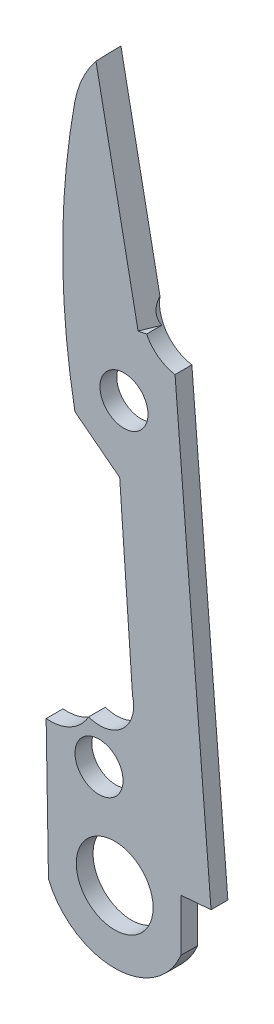
ISO-10303-21;
HEADER;
FILE_DESCRIPTION(('STEP AP214'),'2;1');
FILE_NAME('part.step','',(''),(''),'','','');
FILE_SCHEMA(('AUTOMOTIVE_DESIGN { 1 0 10303 214 1 1 1 1 }'));
ENDSEC;
DATA;
#1=APPLICATION_CONTEXT('core data for automotive mechanical design processes');
#2=APPLICATION_PROTOCOL_DEFINITION('international standard','automotive_design',2000,#1);
#3=PRODUCT_CONTEXT('',#1,'mechanical');
#4=PRODUCT('Part','Part','',(#3));
#5=PRODUCT_RELATED_PRODUCT_CATEGORY('part','',(#4));
#6=PRODUCT_DEFINITION_FORMATION('','',#4);
#7=PRODUCT_DEFINITION_CONTEXT('part definition',#1,'design');
#8=PRODUCT_DEFINITION('design','',#6,#7);
#9=PRODUCT_DEFINITION_SHAPE('','',#8);
#10=(LENGTH_UNIT() NAMED_UNIT(*) SI_UNIT(.MILLI.,.METRE.));
#11=(NAMED_UNIT(*) PLANE_ANGLE_UNIT() SI_UNIT($,.RADIAN.));
#12=(NAMED_UNIT(*) SI_UNIT($,.STERADIAN.) SOLID_ANGLE_UNIT());
#13=UNCERTAINTY_MEASURE_WITH_UNIT(LENGTH_MEASURE(1.E-05),#10,'distance_accuracy_value','');
#14=(GEOMETRIC_REPRESENTATION_CONTEXT(3) GLOBAL_UNCERTAINTY_ASSIGNED_CONTEXT((#13)) GLOBAL_UNIT_ASSIGNED_CONTEXT((#10,
#11,#12)) REPRESENTATION_CONTEXT('',''));
#15=CARTESIAN_POINT('',(0.,0.,0.));
#16=DIRECTION('',(0.,0.,1.));
#17=DIRECTION('',(1.,0.,0.));
#18=AXIS2_PLACEMENT_3D('',#15,#16,#17);
#19=CARTESIAN_POINT('',(58.298969551053,52.7412036113282,0.889000000000001));
#20=DIRECTION('',(0.,0.,-1.));
#21=DIRECTION('',(-1.,0.,0.));
#22=AXIS2_PLACEMENT_3D('',#19,#20,#21);
#23=PLANE('',#22);
#24=CARTESIAN_POINT('',(55.1062842474313,18.8908068192465,0.889000000000001));
#25=DIRECTION('',(0.,0.,1.));
#26=DIRECTION('',(1.,0.,0.));
#27=AXIS2_PLACEMENT_3D('',#24,#25,#26);
#28=CIRCLE('',#27,2.032);
#29=CARTESIAN_POINT('',(57.1382842474313,18.8908068192465,0.889000000000001));
#30=VERTEX_POINT('',#29);
#31=EDGE_CURVE('E310',#30,#30,#28,.T.);
#32=ORIENTED_EDGE('',*,*,#31,.F.);
#33=EDGE_LOOP('',(#32));
#34=FACE_BOUND('',#33,.T.);
#35=DIRECTION('',(0.980952450730075,0.19424801004556,0.));
#36=VECTOR('',#35,1.);
#37=CARTESIAN_POINT('',(56.343765892356,44.9053107233274,0.889000000000001));
#38=LINE('',#37,#36);
#39=CARTESIAN_POINT('',(56.343765892356,44.9053107233274,0.889000000000001));
#40=VERTEX_POINT('',#39);
#41=CARTESIAN_POINT('',(56.795451542172,44.9947534262612,0.889000000000001));
#42=VERTEX_POINT('',#41);
#43=EDGE_CURVE('E295',#40,#42,#38,.T.);
#44=ORIENTED_EDGE('',*,*,#43,.F.);
#45=DIRECTION('',(-0.194248010045559,0.980952450730075,0.));
#46=VECTOR('',#45,1.);
#47=CARTESIAN_POINT('',(56.343765892356,44.9053107233274,0.889000000000001));
#48=LINE('',#47,#46);
#49=CARTESIAN_POINT('',(54.1176052106896,56.1474221657424,0.889000000000001));
#50=VERTEX_POINT('',#49);
#51=EDGE_CURVE('E304',#40,#50,#48,.T.);
#52=ORIENTED_EDGE('',*,*,#51,.T.);
#53=CARTESIAN_POINT('',(58.298969551053,52.7412036113282,0.889000000000001));
#54=DIRECTION('',(0.,0.,1.));
#55=DIRECTION('',(-1.,0.,0.));
#56=AXIS2_PLACEMENT_3D('',#53,#54,#55);
#57=CIRCLE('',#56,5.39315608779291);
#58=CARTESIAN_POINT('',(52.9934122039925,53.7092913265433,0.889000000000001));
#59=VERTEX_POINT('',#58);
#60=EDGE_CURVE('E132',#50,#59,#57,.T.);
#61=ORIENTED_EDGE('',*,*,#60,.T.);
#62=CARTESIAN_POINT('',(91.6745057375456,46.6512785653269,0.889000000000001));
#63=DIRECTION('',(0.,0.,1.));
#64=DIRECTION('',(1.,0.,0.));
#65=AXIS2_PLACEMENT_3D('',#62,#63,#64);
#66=CIRCLE('',#65,39.3197474698017);
#67=CARTESIAN_POINT('',(53.003003996925,39.540899235491,0.889000000000001));
#68=VERTEX_POINT('',#67);
#69=EDGE_CURVE('E271',#59,#68,#66,.T.);
#70=ORIENTED_EDGE('',*,*,#69,.T.);
#71=DIRECTION('',(0.791232931065585,-0.611514880274686,0.));
#72=VECTOR('',#71,1.);
#73=CARTESIAN_POINT('',(53.003003996925,39.540899235491,0.889000000000001));
#74=LINE('',#73,#72);
#75=CARTESIAN_POINT('',(55.3713844992906,37.7104649063757,0.889000000000001));
#76=VERTEX_POINT('',#75);
#77=EDGE_CURVE('E341',#68,#76,#74,.T.);
#78=ORIENTED_EDGE('',*,*,#77,.T.);
#79=DIRECTION('',(0.0703645759459659,-0.997521341351625,0.));
#80=VECTOR('',#79,1.);
#81=CARTESIAN_POINT('',(55.3713844992906,37.7104649063757,0.889000000000001));
#82=LINE('',#81,#80);
#83=CARTESIAN_POINT('',(56.0523119481275,28.0573169552183,0.889000000000001));
#84=VERTEX_POINT('',#83);
#85=EDGE_CURVE('E344',#76,#84,#82,.T.);
#86=ORIENTED_EDGE('',*,*,#85,.T.);
#87=CARTESIAN_POINT('',(54.3184141104705,27.6130962247955,0.889000000000001));
#88=DIRECTION('',(0.,0.,-1.));
#89=DIRECTION('',(-1.,0.,0.));
#90=AXIS2_PLACEMENT_3D('',#87,#88,#89);
#91=CIRCLE('',#90,1.78989769784999);
#92=CARTESIAN_POINT('',(53.7244696692905,25.9246165034011,0.889000000000001));
#93=VERTEX_POINT('',#92);
#94=EDGE_CURVE('E347',#84,#93,#91,.T.);
#95=ORIENTED_EDGE('',*,*,#94,.T.);
#96=CARTESIAN_POINT('',(51.6858105737163,27.0435972886485,0.889000000000001));
#97=DIRECTION('',(0.,0.,-1.));
#98=DIRECTION('',(-1.,0.,0.));
#99=AXIS2_PLACEMENT_3D('',#96,#97,#98);
#100=CIRCLE('',#99,2.32556421234084);
#101=CARTESIAN_POINT('',(51.4813817478412,24.7270356639832,0.889000000000001));
#102=VERTEX_POINT('',#101);
#103=EDGE_CURVE('E350',#93,#102,#100,.T.);
#104=ORIENTED_EDGE('',*,*,#103,.T.);
#105=DIRECTION('',(0.0169800187734466,-0.999855829088601,0.));
#106=VECTOR('',#105,1.);
#107=CARTESIAN_POINT('',(51.4813817478412,24.7270356639832,0.889000000000001));
#108=LINE('',#107,#106);
#109=CARTESIAN_POINT('',(51.6050919668254,17.4424510460544,0.889000000000001));
#110=VERTEX_POINT('',#109);
#111=EDGE_CURVE('E353',#102,#110,#108,.T.);
#112=ORIENTED_EDGE('',*,*,#111,.T.);
#113=CARTESIAN_POINT('',(55.1062842474313,18.8908068192465,0.889000000000001));
#114=DIRECTION('',(0.,0.,1.));
#115=DIRECTION('',(1.,0.,0.));
#116=AXIS2_PLACEMENT_3D('',#113,#114,#115);
#117=CIRCLE('',#116,3.78894204647071);
#118=CARTESIAN_POINT('',(58.6074765280373,17.4424510460544,0.889000000000001));
#119=VERTEX_POINT('',#118);
#120=EDGE_CURVE('E165',#110,#119,#117,.T.);
#121=ORIENTED_EDGE('',*,*,#120,.T.);
#122=DIRECTION('',(0.,1.,0.));
#123=VECTOR('',#122,1.);
#124=CARTESIAN_POINT('',(58.6074765280373,20.1999738695472,0.889000000000001));
#125=LINE('',#124,#123);
#126=CARTESIAN_POINT('',(58.6074765280373,20.1999738695472,0.889000000000001));
#127=VERTEX_POINT('',#126);
#128=EDGE_CURVE('E157',#119,#127,#125,.T.);
#129=ORIENTED_EDGE('',*,*,#128,.T.);
#130=DIRECTION('',(0.996750440683807,0.080551592142162,0.));
#131=VECTOR('',#130,1.);
#132=CARTESIAN_POINT('',(60.2030911210144,20.328922190675,0.889000000000001));
#133=LINE('',#132,#131);
#134=CARTESIAN_POINT('',(60.2030911210144,20.328922190675,0.889000000000001));
#135=VERTEX_POINT('',#134);
#136=EDGE_CURVE('E162',#127,#135,#133,.T.);
#137=ORIENTED_EDGE('',*,*,#136,.T.);
#138=DIRECTION('',(-0.0805515921421626,0.996750440683807,0.));
#139=VECTOR('',#138,1.);
#140=CARTESIAN_POINT('',(58.298969551053,43.8906416241651,0.889000000000001));
#141=LINE('',#140,#139);
#142=CARTESIAN_POINT('',(58.298969551053,43.8906416241651,0.889000000000001));
#143=VERTEX_POINT('',#142);
#144=EDGE_CURVE('E75',#135,#143,#141,.T.);
#145=ORIENTED_EDGE('',*,*,#144,.T.);
#146=CARTESIAN_POINT('',(58.6074765280373,45.8865087354998,0.889000000000001));
#147=DIRECTION('',(0.,0.,-1.));
#148=DIRECTION('',(1.,0.,0.));
#149=AXIS2_PLACEMENT_3D('',#146,#147,#148);
#150=CIRCLE('',#149,2.01956977620369);
#151=EDGE_CURVE('E188',#143,#42,#150,.T.);
#152=ORIENTED_EDGE('',*,*,#151,.T.);
#153=EDGE_LOOP('',(#44,#52,#61,#70,#78,#86,#95,#104,#112,#121,#129,#137,#145,#152));
#154=FACE_BOUND('',#153,.T.);
#155=CARTESIAN_POINT('',(54.2776006803347,23.9125007125022,0.889000000000001));
#156=DIRECTION('',(0.,0.,1.));
#157=DIRECTION('',(1.,0.,0.));
#158=AXIS2_PLACEMENT_3D('',#155,#156,#157);
#159=CIRCLE('',#158,1.27);
#160=CARTESIAN_POINT('',(55.5476006803347,23.9125007125022,0.889000000000001));
#161=VERTEX_POINT('',#160);
#162=EDGE_CURVE('E200',#161,#161,#159,.T.);
#163=ORIENTED_EDGE('',*,*,#162,.F.);
#164=EDGE_LOOP('',(#163));
#165=FACE_BOUND('',#164,.T.);
#166=CARTESIAN_POINT('',(55.596905373983,41.3468012643006,0.889000000000001));
#167=DIRECTION('',(0.,0.,1.));
#168=DIRECTION('',(1.,0.,0.));
#169=AXIS2_PLACEMENT_3D('',#166,#167,#168);
#170=CIRCLE('',#169,1.27);
#171=CARTESIAN_POINT('',(56.866905373983,41.3468012643006,0.889000000000001));
#172=VERTEX_POINT('',#171);
#173=EDGE_CURVE('E323',#172,#172,#170,.T.);
#174=ORIENTED_EDGE('',*,*,#173,.F.);
#175=EDGE_LOOP('',(#174));
#176=FACE_BOUND('',#175,.T.);
#177=ADVANCED_FACE('F57',(#34,#154,#165,#176),#23,.F.);
#178=CARTESIAN_POINT('',(58.298969551053,52.7412036113282,0.));
#179=DIRECTION('',(0.,0.,-1.));
#180=DIRECTION('',(-1.,0.,0.));
#181=AXIS2_PLACEMENT_3D('',#178,#179,#180);
#182=PLANE('',#181);
#183=CARTESIAN_POINT('',(55.1062842474313,18.8908068192465,0.));
#184=DIRECTION('',(0.,0.,1.));
#185=DIRECTION('',(1.,0.,0.));
#186=AXIS2_PLACEMENT_3D('',#183,#184,#185);
#187=CIRCLE('',#186,2.032);
#188=CARTESIAN_POINT('',(57.1382842474313,18.8908068192465,0.));
#189=VERTEX_POINT('',#188);
#190=EDGE_CURVE('E315',#189,#189,#187,.T.);
#191=ORIENTED_EDGE('',*,*,#190,.T.);
#192=EDGE_LOOP('',(#191));
#193=FACE_BOUND('',#192,.T.);
#194=CARTESIAN_POINT('',(54.2776006803347,23.9125007125022,0.));
#195=DIRECTION('',(0.,0.,1.));
#196=DIRECTION('',(1.,0.,0.));
#197=AXIS2_PLACEMENT_3D('',#194,#195,#196);
#198=CIRCLE('',#197,1.27);
#199=CARTESIAN_POINT('',(55.5476006803347,23.9125007125022,0.));
#200=VERTEX_POINT('',#199);
#201=EDGE_CURVE('E327',#200,#200,#198,.T.);
#202=ORIENTED_EDGE('',*,*,#201,.T.);
#203=EDGE_LOOP('',(#202));
#204=FACE_BOUND('',#203,.T.);
#205=CARTESIAN_POINT('',(58.298969551053,52.7412036113282,0.));
#206=DIRECTION('',(0.,0.,1.));
#207=DIRECTION('',(-1.,0.,0.));
#208=AXIS2_PLACEMENT_3D('',#205,#206,#207);
#209=CIRCLE('',#208,5.39315608779291);
#210=CARTESIAN_POINT('',(54.5479908301483,56.6162895745835,0.));
#211=VERTEX_POINT('',#210);
#212=CARTESIAN_POINT('',(52.9934122039925,53.7092913265433,0.));
#213=VERTEX_POINT('',#212);
#214=EDGE_CURVE('E195',#211,#213,#209,.T.);
#215=ORIENTED_EDGE('',*,*,#214,.F.);
#216=DIRECTION('',(-0.194248010045559,0.980952450730075,0.));
#217=VECTOR('',#216,1.);
#218=CARTESIAN_POINT('',(54.5479908301483,56.6162895745835,0.));
#219=LINE('',#218,#217);
#220=CARTESIAN_POINT('',(56.6116094167026,46.1950157124842,0.));
#221=VERTEX_POINT('',#220);
#222=EDGE_CURVE('E231',#221,#211,#219,.T.);
#223=ORIENTED_EDGE('',*,*,#222,.F.);
#224=CARTESIAN_POINT('',(58.6074765280373,45.8865087354998,0.));
#225=DIRECTION('',(0.,0.,-1.));
#226=DIRECTION('',(1.,0.,0.));
#227=AXIS2_PLACEMENT_3D('',#224,#225,#226);
#228=CIRCLE('',#227,2.01956977620369);
#229=CARTESIAN_POINT('',(58.298969551053,43.8906416241651,0.));
#230=VERTEX_POINT('',#229);
#231=EDGE_CURVE('E228',#230,#221,#228,.T.);
#232=ORIENTED_EDGE('',*,*,#231,.F.);
#233=DIRECTION('',(-0.0805515921421626,0.996750440683807,0.));
#234=VECTOR('',#233,1.);
#235=CARTESIAN_POINT('',(58.298969551053,43.8906416241651,0.));
#236=LINE('',#235,#234);
#237=CARTESIAN_POINT('',(60.2030911210144,20.328922190675,0.));
#238=VERTEX_POINT('',#237);
#239=EDGE_CURVE('E116',#238,#230,#236,.T.);
#240=ORIENTED_EDGE('',*,*,#239,.F.);
#241=DIRECTION('',(0.996750440683807,0.080551592142162,0.));
#242=VECTOR('',#241,1.);
#243=CARTESIAN_POINT('',(60.2030911210144,20.328922190675,0.));
#244=LINE('',#243,#242);
#245=CARTESIAN_POINT('',(58.6074765280373,20.1999738695472,0.));
#246=VERTEX_POINT('',#245);
#247=EDGE_CURVE('E223',#246,#238,#244,.T.);
#248=ORIENTED_EDGE('',*,*,#247,.F.);
#249=DIRECTION('',(0.,1.,0.));
#250=VECTOR('',#249,1.);
#251=CARTESIAN_POINT('',(58.6074765280373,20.1999738695472,0.));
#252=LINE('',#251,#250);
#253=CARTESIAN_POINT('',(58.6074765280373,17.4424510460544,0.));
#254=VERTEX_POINT('',#253);
#255=EDGE_CURVE('E175',#254,#246,#252,.T.);
#256=ORIENTED_EDGE('',*,*,#255,.F.);
#257=CARTESIAN_POINT('',(55.1062842474313,18.8908068192465,0.));
#258=DIRECTION('',(0.,0.,1.));
#259=DIRECTION('',(1.,0.,0.));
#260=AXIS2_PLACEMENT_3D('',#257,#258,#259);
#261=CIRCLE('',#260,3.78894204647071);
#262=CARTESIAN_POINT('',(51.6050919668254,17.4424510460544,0.));
#263=VERTEX_POINT('',#262);
#264=EDGE_CURVE('E218',#263,#254,#261,.T.);
#265=ORIENTED_EDGE('',*,*,#264,.F.);
#266=DIRECTION('',(0.0169800187734466,-0.999855829088601,0.));
#267=VECTOR('',#266,1.);
#268=CARTESIAN_POINT('',(51.4813817478412,24.7270356639832,0.));
#269=LINE('',#268,#267);
#270=CARTESIAN_POINT('',(51.4813817478412,24.7270356639832,0.));
#271=VERTEX_POINT('',#270);
#272=EDGE_CURVE('E215',#271,#263,#269,.T.);
#273=ORIENTED_EDGE('',*,*,#272,.F.);
#274=CARTESIAN_POINT('',(51.6858105737163,27.0435972886485,0.));
#275=DIRECTION('',(0.,0.,-1.));
#276=DIRECTION('',(-1.,0.,0.));
#277=AXIS2_PLACEMENT_3D('',#274,#275,#276);
#278=CIRCLE('',#277,2.32556421234084);
#279=CARTESIAN_POINT('',(53.7244696692905,25.9246165034011,0.));
#280=VERTEX_POINT('',#279);
#281=EDGE_CURVE('E212',#280,#271,#278,.T.);
#282=ORIENTED_EDGE('',*,*,#281,.F.);
#283=CARTESIAN_POINT('',(54.3184141104705,27.6130962247955,0.));
#284=DIRECTION('',(0.,0.,-1.));
#285=DIRECTION('',(-1.,0.,0.));
#286=AXIS2_PLACEMENT_3D('',#283,#284,#285);
#287=CIRCLE('',#286,1.78989769784999);
#288=CARTESIAN_POINT('',(56.0523119481275,28.0573169552183,0.));
#289=VERTEX_POINT('',#288);
#290=EDGE_CURVE('E209',#289,#280,#287,.T.);
#291=ORIENTED_EDGE('',*,*,#290,.F.);
#292=DIRECTION('',(0.0703645759459659,-0.997521341351625,0.));
#293=VECTOR('',#292,1.);
#294=CARTESIAN_POINT('',(55.3713844992906,37.7104649063757,0.));
#295=LINE('',#294,#293);
#296=CARTESIAN_POINT('',(55.3713844992906,37.7104649063757,0.));
#297=VERTEX_POINT('',#296);
#298=EDGE_CURVE('E206',#297,#289,#295,.T.);
#299=ORIENTED_EDGE('',*,*,#298,.F.);
#300=DIRECTION('',(0.791232931065585,-0.611514880274686,0.));
#301=VECTOR('',#300,1.);
#302=CARTESIAN_POINT('',(53.003003996925,39.540899235491,0.));
#303=LINE('',#302,#301);
#304=CARTESIAN_POINT('',(53.003003996925,39.540899235491,0.));
#305=VERTEX_POINT('',#304);
#306=EDGE_CURVE('E203',#305,#297,#303,.T.);
#307=ORIENTED_EDGE('',*,*,#306,.F.);
#308=CARTESIAN_POINT('',(91.6745057375456,46.6512785653269,0.));
#309=DIRECTION('',(0.,0.,1.));
#310=DIRECTION('',(1.,0.,0.));
#311=AXIS2_PLACEMENT_3D('',#308,#309,#310);
#312=CIRCLE('',#311,39.3197474698017);
#313=EDGE_CURVE('E199',#213,#305,#312,.T.);
#314=ORIENTED_EDGE('',*,*,#313,.F.);
#315=EDGE_LOOP('',(#215,#223,#232,#240,#248,#256,#265,#273,#282,#291,#299,#307,#314));
#316=FACE_BOUND('',#315,.T.);
#317=CARTESIAN_POINT('',(55.596905373983,41.3468012643006,0.));
#318=DIRECTION('',(0.,0.,1.));
#319=DIRECTION('',(1.,0.,0.));
#320=AXIS2_PLACEMENT_3D('',#317,#318,#319);
#321=CIRCLE('',#320,1.27);
#322=CARTESIAN_POINT('',(56.866905373983,41.3468012643006,0.));
#323=VERTEX_POINT('',#322);
#324=EDGE_CURVE('E319',#323,#323,#321,.T.);
#325=ORIENTED_EDGE('',*,*,#324,.T.);
#326=EDGE_LOOP('',(#325));
#327=FACE_BOUND('',#326,.T.);
#328=ADVANCED_FACE('F280',(#193,#204,#316,#327),#182,.T.);
#329=CARTESIAN_POINT('',(58.298969551053,52.7412036113282,0.889000000000001));
#330=DIRECTION('',(0.,0.,-1.));
#331=DIRECTION('',(-1.,0.,0.));
#332=AXIS2_PLACEMENT_3D('',#329,#330,#331);
#333=CYLINDRICAL_SURFACE('',#332,5.39315608779291);
#334=ORIENTED_EDGE('',*,*,#60,.F.);
#335=CARTESIAN_POINT('',(58.298969551053,52.7412036113282,-5.0693732868578));
#336=DIRECTION('',(-0.849529742236853,-0.16822371133403,-0.499999999999991));
#337=DIRECTION('',(0.490476225365029,0.0971240050227778,-0.866025403784444));
#338=AXIS2_PLACEMENT_3D('',#335,#336,#337);
#339=ELLIPSE('',#338,10.786312175586,5.39315608779291);
#340=EDGE_CURVE('E277',#50,#211,#339,.T.);
#341=ORIENTED_EDGE('',*,*,#340,.T.);
#342=ORIENTED_EDGE('',*,*,#214,.T.);
#343=DIRECTION('',(0.,0.,-1.));
#344=VECTOR('',#343,1.);
#345=CARTESIAN_POINT('',(52.9934122039925,53.7092913265433,0.889000000000001));
#346=LINE('',#345,#344);
#347=EDGE_CURVE('E67',#59,#213,#346,.T.);
#348=ORIENTED_EDGE('',*,*,#347,.F.);
#349=EDGE_LOOP('',(#334,#341,#342,#348));
#350=FACE_BOUND('',#349,.T.);
#351=ADVANCED_FACE('F59',(#350),#333,.T.);
#352=CARTESIAN_POINT('',(91.6745057375456,46.6512785653269,0.889000000000001));
#353=DIRECTION('',(0.,0.,-1.));
#354=DIRECTION('',(-1.,0.,0.));
#355=AXIS2_PLACEMENT_3D('',#352,#353,#354);
#356=CYLINDRICAL_SURFACE('',#355,39.3197474698017);
#357=ORIENTED_EDGE('',*,*,#313,.T.);
#358=DIRECTION('',(0.,0.,-1.));
#359=VECTOR('',#358,1.);
#360=CARTESIAN_POINT('',(53.003003996925,39.540899235491,0.889000000000001));
#361=LINE('',#360,#359);
#362=EDGE_CURVE('E260',#68,#305,#361,.T.);
#363=ORIENTED_EDGE('',*,*,#362,.F.);
#364=ORIENTED_EDGE('',*,*,#69,.F.);
#365=ORIENTED_EDGE('',*,*,#347,.T.);
#366=EDGE_LOOP('',(#357,#363,#364,#365));
#367=FACE_BOUND('',#366,.T.);
#368=ADVANCED_FACE('F269',(#367),#356,.T.);
#369=CARTESIAN_POINT('',(53.003003996925,39.540899235491,0.889000000000001));
#370=DIRECTION('',(0.611514880274686,0.791232931065585,0.));
#371=DIRECTION('',(-0.791232931065585,0.611514880274686,0.));
#372=AXIS2_PLACEMENT_3D('',#369,#370,#371);
#373=PLANE('',#372);
#374=ORIENTED_EDGE('',*,*,#306,.T.);
#375=DIRECTION('',(0.,0.,-1.));
#376=VECTOR('',#375,1.);
#377=CARTESIAN_POINT('',(55.3713844992906,37.7104649063757,0.889000000000001));
#378=LINE('',#377,#376);
#379=EDGE_CURVE('E256',#76,#297,#378,.T.);
#380=ORIENTED_EDGE('',*,*,#379,.F.);
#381=ORIENTED_EDGE('',*,*,#77,.F.);
#382=ORIENTED_EDGE('',*,*,#362,.T.);
#383=EDGE_LOOP('',(#374,#380,#381,#382));
#384=FACE_BOUND('',#383,.T.);
#385=ADVANCED_FACE('F580',(#384),#373,.F.);
#386=CARTESIAN_POINT('',(55.3713844992906,37.7104649063757,0.889000000000001));
#387=DIRECTION('',(0.997521341351625,0.0703645759459659,0.));
#388=DIRECTION('',(-0.070364575945966,0.997521341351625,0.));
#389=AXIS2_PLACEMENT_3D('',#386,#387,#388);
#390=PLANE('',#389);
#391=ORIENTED_EDGE('',*,*,#298,.T.);
#392=DIRECTION('',(0.,0.,-1.));
#393=VECTOR('',#392,1.);
#394=CARTESIAN_POINT('',(56.0523119481275,28.0573169552183,0.889000000000001));
#395=LINE('',#394,#393);
#396=EDGE_CURVE('E252',#84,#289,#395,.T.);
#397=ORIENTED_EDGE('',*,*,#396,.F.);
#398=ORIENTED_EDGE('',*,*,#85,.F.);
#399=ORIENTED_EDGE('',*,*,#379,.T.);
#400=EDGE_LOOP('',(#391,#397,#398,#399));
#401=FACE_BOUND('',#400,.T.);
#402=ADVANCED_FACE('F571',(#401),#390,.F.);
#403=CARTESIAN_POINT('',(54.3184141104705,27.6130962247955,0.889000000000001));
#404=DIRECTION('',(0.,0.,-1.));
#405=DIRECTION('',(-1.,0.,0.));
#406=AXIS2_PLACEMENT_3D('',#403,#404,#405);
#407=CYLINDRICAL_SURFACE('',#406,1.78989769784999);
#408=ORIENTED_EDGE('',*,*,#290,.T.);
#409=DIRECTION('',(0.,0.,-1.));
#410=VECTOR('',#409,1.);
#411=CARTESIAN_POINT('',(53.7244696692905,25.9246165034011,0.889000000000001));
#412=LINE('',#411,#410);
#413=EDGE_CURVE('E248',#93,#280,#412,.T.);
#414=ORIENTED_EDGE('',*,*,#413,.F.);
#415=ORIENTED_EDGE('',*,*,#94,.F.);
#416=ORIENTED_EDGE('',*,*,#396,.T.);
#417=EDGE_LOOP('',(#408,#414,#415,#416));
#418=FACE_BOUND('',#417,.T.);
#419=ADVANCED_FACE('F562',(#418),#407,.F.);
#420=CARTESIAN_POINT('',(51.6858105737163,27.0435972886485,0.889000000000001));
#421=DIRECTION('',(0.,0.,-1.));
#422=DIRECTION('',(-1.,0.,0.));
#423=AXIS2_PLACEMENT_3D('',#420,#421,#422);
#424=CYLINDRICAL_SURFACE('',#423,2.32556421234084);
#425=ORIENTED_EDGE('',*,*,#281,.T.);
#426=DIRECTION('',(0.,0.,-1.));
#427=VECTOR('',#426,1.);
#428=CARTESIAN_POINT('',(51.4813817478412,24.7270356639832,0.889000000000001));
#429=LINE('',#428,#427);
#430=EDGE_CURVE('E244',#102,#271,#429,.T.);
#431=ORIENTED_EDGE('',*,*,#430,.F.);
#432=ORIENTED_EDGE('',*,*,#103,.F.);
#433=ORIENTED_EDGE('',*,*,#413,.T.);
#434=EDGE_LOOP('',(#425,#431,#432,#433));
#435=FACE_BOUND('',#434,.T.);
#436=ADVANCED_FACE('F554',(#435),#424,.F.);
#437=CARTESIAN_POINT('',(51.4813817478412,24.7270356639832,0.889000000000001));
#438=DIRECTION('',(0.999855829088601,0.0169800187734466,0.));
#439=DIRECTION('',(-0.0169800187734466,0.999855829088601,0.));
#440=AXIS2_PLACEMENT_3D('',#437,#438,#439);
#441=PLANE('',#440);
#442=ORIENTED_EDGE('',*,*,#272,.T.);
#443=DIRECTION('',(0.,0.,-1.));
#444=VECTOR('',#443,1.);
#445=CARTESIAN_POINT('',(51.6050919668254,17.4424510460544,0.889000000000001));
#446=LINE('',#445,#444);
#447=EDGE_CURVE('E240',#110,#263,#446,.T.);
#448=ORIENTED_EDGE('',*,*,#447,.F.);
#449=ORIENTED_EDGE('',*,*,#111,.F.);
#450=ORIENTED_EDGE('',*,*,#430,.T.);
#451=EDGE_LOOP('',(#442,#448,#449,#450));
#452=FACE_BOUND('',#451,.T.);
#453=ADVANCED_FACE('F452',(#452),#441,.F.);
#454=CARTESIAN_POINT('',(55.1062842474313,18.8908068192465,0.889000000000001));
#455=DIRECTION('',(0.,0.,-1.));
#456=DIRECTION('',(-1.,0.,0.));
#457=AXIS2_PLACEMENT_3D('',#454,#455,#456);
#458=CYLINDRICAL_SURFACE('',#457,3.78894204647071);
#459=ORIENTED_EDGE('',*,*,#264,.T.);
#460=DIRECTION('',(0.,0.,-1.));
#461=VECTOR('',#460,1.);
#462=CARTESIAN_POINT('',(58.6074765280373,17.4424510460544,0.889000000000001));
#463=LINE('',#462,#461);
#464=EDGE_CURVE('E179',#119,#254,#463,.T.);
#465=ORIENTED_EDGE('',*,*,#464,.F.);
#466=ORIENTED_EDGE('',*,*,#120,.F.);
#467=ORIENTED_EDGE('',*,*,#447,.T.);
#468=EDGE_LOOP('',(#459,#465,#466,#467));
#469=FACE_BOUND('',#468,.T.);
#470=ADVANCED_FACE('F456',(#469),#458,.T.);
#471=CARTESIAN_POINT('',(58.6074765280373,20.1999738695472,0.889000000000001));
#472=DIRECTION('',(-1.,0.,0.));
#473=DIRECTION('',(0.,0.,1.));
#474=AXIS2_PLACEMENT_3D('',#471,#472,#473);
#475=PLANE('',#474);
#476=ORIENTED_EDGE('',*,*,#255,.T.);
#477=DIRECTION('',(0.,0.,-1.));
#478=VECTOR('',#477,1.);
#479=CARTESIAN_POINT('',(58.6074765280373,20.1999738695472,0.889000000000001));
#480=LINE('',#479,#478);
#481=EDGE_CURVE('E172',#127,#246,#480,.T.);
#482=ORIENTED_EDGE('',*,*,#481,.F.);
#483=ORIENTED_EDGE('',*,*,#128,.F.);
#484=ORIENTED_EDGE('',*,*,#464,.T.);
#485=EDGE_LOOP('',(#476,#482,#483,#484));
#486=FACE_BOUND('',#485,.T.);
#487=ADVANCED_FACE('F173',(#486),#475,.F.);
#488=CARTESIAN_POINT('',(60.2030911210144,20.328922190675,0.889000000000001));
#489=DIRECTION('',(-0.080551592142162,0.996750440683807,0.));
#490=DIRECTION('',(-0.996750440683807,-0.080551592142162,0.));
#491=AXIS2_PLACEMENT_3D('',#488,#489,#490);
#492=PLANE('',#491);
#493=ORIENTED_EDGE('',*,*,#247,.T.);
#494=DIRECTION('',(0.,0.,-1.));
#495=VECTOR('',#494,1.);
#496=CARTESIAN_POINT('',(60.2030911210144,20.328922190675,0.889000000000001));
#497=LINE('',#496,#495);
#498=EDGE_CURVE('E180',#135,#238,#497,.T.);
#499=ORIENTED_EDGE('',*,*,#498,.F.);
#500=ORIENTED_EDGE('',*,*,#136,.F.);
#501=ORIENTED_EDGE('',*,*,#481,.T.);
#502=EDGE_LOOP('',(#493,#499,#500,#501));
#503=FACE_BOUND('',#502,.T.);
#504=ADVANCED_FACE('F182',(#503),#492,.F.);
#505=CARTESIAN_POINT('',(58.298969551053,43.8906416241651,0.889000000000001));
#506=DIRECTION('',(-0.996750440683807,-0.0805515921421626,0.));
#507=DIRECTION('',(0.0805515921421626,-0.996750440683807,0.));
#508=AXIS2_PLACEMENT_3D('',#505,#506,#507);
#509=PLANE('',#508);
#510=ORIENTED_EDGE('',*,*,#239,.T.);
#511=DIRECTION('',(0.,0.,-1.));
#512=VECTOR('',#511,1.);
#513=CARTESIAN_POINT('',(58.298969551053,43.8906416241651,0.889000000000001));
#514=LINE('',#513,#512);
#515=EDGE_CURVE('E194',#143,#230,#514,.T.);
#516=ORIENTED_EDGE('',*,*,#515,.F.);
#517=ORIENTED_EDGE('',*,*,#144,.F.);
#518=ORIENTED_EDGE('',*,*,#498,.T.);
#519=EDGE_LOOP('',(#510,#516,#517,#518));
#520=FACE_BOUND('',#519,.T.);
#521=ADVANCED_FACE('F457',(#520),#509,.F.);
#522=CARTESIAN_POINT('',(58.6074765280373,45.8865087354998,0.889000000000001));
#523=DIRECTION('',(0.,0.,-1.));
#524=DIRECTION('',(-1.,0.,0.));
#525=AXIS2_PLACEMENT_3D('',#522,#523,#524);
#526=CYLINDRICAL_SURFACE('',#525,2.01956977620369);
#527=ORIENTED_EDGE('',*,*,#231,.T.);
#528=CARTESIAN_POINT('',(58.6074765280373,45.8865087354998,-3.2873005679809));
#529=DIRECTION('',(-0.849529742236853,-0.16822371133403,-0.499999999999991));
#530=DIRECTION('',(0.490476225365029,0.0971240050227778,-0.866025403784444));
#531=AXIS2_PLACEMENT_3D('',#528,#529,#530);
#532=ELLIPSE('',#531,4.03913955240745,2.01956977620369);
#533=CARTESIAN_POINT('',(56.795451542172,44.9947534262612,0.0914664458008495));
#534=VERTEX_POINT('',#533);
#535=EDGE_CURVE('E124',#221,#534,#532,.F.);
#536=ORIENTED_EDGE('',*,*,#535,.T.);
#537=DIRECTION('',(0.,0.,-1.));
#538=VECTOR('',#537,1.);
#539=CARTESIAN_POINT('',(56.795451542172,44.9947534262612,0.889000000000001));
#540=LINE('',#539,#538);
#541=EDGE_CURVE('E13',#534,#42,#540,.F.);
#542=ORIENTED_EDGE('',*,*,#541,.T.);
#543=ORIENTED_EDGE('',*,*,#151,.F.);
#544=ORIENTED_EDGE('',*,*,#515,.T.);
#545=EDGE_LOOP('',(#527,#536,#542,#543,#544));
#546=FACE_BOUND('',#545,.T.);
#547=ADVANCED_FACE('F302',(#546),#526,.F.);
#548=CARTESIAN_POINT('',(54.2776006803347,23.9125007125022,0.889000000000001));
#549=DIRECTION('',(0.,0.,-1.));
#550=DIRECTION('',(-1.,0.,0.));
#551=AXIS2_PLACEMENT_3D('',#548,#549,#550);
#552=CYLINDRICAL_SURFACE('',#551,1.27);
#553=ORIENTED_EDGE('',*,*,#162,.T.);
#554=EDGE_LOOP('',(#553));
#555=FACE_BOUND('',#554,.T.);
#556=ORIENTED_EDGE('',*,*,#201,.F.);
#557=EDGE_LOOP('',(#556));
#558=FACE_BOUND('',#557,.T.);
#559=ADVANCED_FACE('F464',(#555,#558),#552,.F.);
#560=CARTESIAN_POINT('',(55.596905373983,41.3468012643006,0.889000000000001));
#561=DIRECTION('',(0.,0.,-1.));
#562=DIRECTION('',(-1.,0.,0.));
#563=AXIS2_PLACEMENT_3D('',#560,#561,#562);
#564=CYLINDRICAL_SURFACE('',#563,1.27);
#565=ORIENTED_EDGE('',*,*,#173,.T.);
#566=EDGE_LOOP('',(#565));
#567=FACE_BOUND('',#566,.T.);
#568=ORIENTED_EDGE('',*,*,#324,.F.);
#569=EDGE_LOOP('',(#568));
#570=FACE_BOUND('',#569,.T.);
#571=ADVANCED_FACE('F479',(#567,#570),#564,.F.);
#572=CARTESIAN_POINT('',(55.1062842474313,18.8908068192465,0.));
#573=DIRECTION('',(0.,0.,1.));
#574=DIRECTION('',(1.,0.,0.));
#575=AXIS2_PLACEMENT_3D('',#572,#573,#574);
#576=CYLINDRICAL_SURFACE('',#575,2.032);
#577=ORIENTED_EDGE('',*,*,#190,.F.);
#578=EDGE_LOOP('',(#577));
#579=FACE_BOUND('',#578,.T.);
#580=ORIENTED_EDGE('',*,*,#31,.T.);
#581=EDGE_LOOP('',(#580));
#582=FACE_BOUND('',#581,.T.);
#583=ADVANCED_FACE('F483',(#579,#582),#576,.F.);
#584=CARTESIAN_POINT('',(-6.43064062863684,32.4747351746159,0.));
#585=DIRECTION('',(0.19424801004556,-0.980952450730075,0.));
#586=DIRECTION('',(0.980952450730075,0.19424801004556,0.));
#587=AXIS2_PLACEMENT_3D('',#584,#585,#586);
#588=PLANE('',#587);
#589=DIRECTION('',(-0.490476225365029,-0.0971240050227782,0.866025403784444));
#590=VECTOR('',#589,1.);
#591=CARTESIAN_POINT('',(56.343765892356,44.9053107233274,0.889000000000001));
#592=LINE('',#591,#590);
#593=EDGE_CURVE('E297',#534,#40,#592,.T.);
#594=ORIENTED_EDGE('',*,*,#593,.T.);
#595=ORIENTED_EDGE('',*,*,#43,.T.);
#596=ORIENTED_EDGE('',*,*,#541,.F.);
#597=EDGE_LOOP('',(#594,#595,#596));
#598=FACE_BOUND('',#597,.T.);
#599=ADVANCED_FACE('F296',(#598),#588,.F.);
#600=CARTESIAN_POINT('',(56.343765892356,44.9053107233274,0.889000000000001));
#601=DIRECTION('',(-0.849529742236853,-0.16822371133403,-0.499999999999991));
#602=DIRECTION('',(-0.507228593949263,0.,0.861811553345773));
#603=AXIS2_PLACEMENT_3D('',#600,#601,#602);
#604=PLANE('',#603);
#605=ORIENTED_EDGE('',*,*,#51,.F.);
#606=ORIENTED_EDGE('',*,*,#593,.F.);
#607=ORIENTED_EDGE('',*,*,#535,.F.);
#608=ORIENTED_EDGE('',*,*,#222,.T.);
#609=ORIENTED_EDGE('',*,*,#340,.F.);
#610=EDGE_LOOP('',(#605,#606,#607,#608,#609));
#611=FACE_BOUND('',#610,.T.);
#612=ADVANCED_FACE('F488',(#611),#604,.F.);
#613=CLOSED_SHELL('',(#177,#328,#351,#368,#385,#402,#419,#436,#453,#470,#487,#504,#521,#547,
#559,#571,#583,#599,#612));
#614=MANIFOLD_SOLID_BREP('B2',#613);
#615=ADVANCED_BREP_SHAPE_REPRESENTATION('',(#18,#614),#14);
#616=SHAPE_DEFINITION_REPRESENTATION(#9,#615);
ENDSEC;
END-ISO-10303-21;
